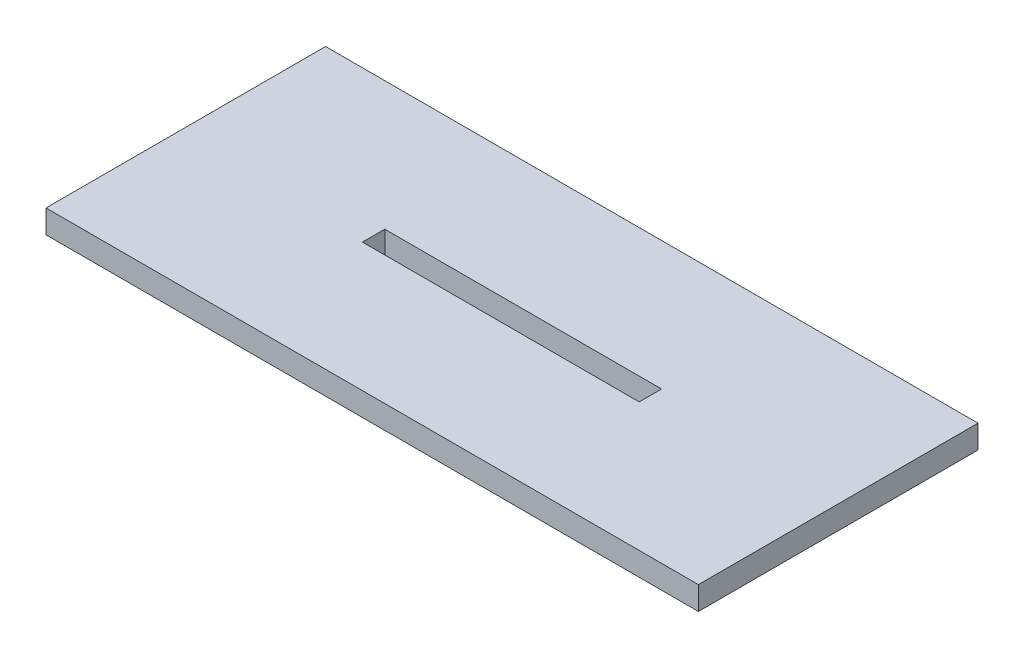
ISO-10303-21;
HEADER;
FILE_DESCRIPTION(('STEP AP214'),'2;1');
FILE_NAME('part.step','',(''),(''),'','','');
FILE_SCHEMA(('AUTOMOTIVE_DESIGN { 1 0 10303 214 1 1 1 1 }'));
ENDSEC;
DATA;
#1=APPLICATION_CONTEXT('core data for automotive mechanical design processes');
#2=APPLICATION_PROTOCOL_DEFINITION('international standard','automotive_design',2000,#1);
#3=PRODUCT_CONTEXT('',#1,'mechanical');
#4=PRODUCT('Part','Part','',(#3));
#5=PRODUCT_RELATED_PRODUCT_CATEGORY('part','',(#4));
#6=PRODUCT_DEFINITION_FORMATION('','',#4);
#7=PRODUCT_DEFINITION_CONTEXT('part definition',#1,'design');
#8=PRODUCT_DEFINITION('design','',#6,#7);
#9=PRODUCT_DEFINITION_SHAPE('','',#8);
#10=(LENGTH_UNIT() NAMED_UNIT(*) SI_UNIT(.MILLI.,.METRE.));
#11=(NAMED_UNIT(*) PLANE_ANGLE_UNIT() SI_UNIT($,.RADIAN.));
#12=(NAMED_UNIT(*) SI_UNIT($,.STERADIAN.) SOLID_ANGLE_UNIT());
#13=UNCERTAINTY_MEASURE_WITH_UNIT(LENGTH_MEASURE(1.E-05),#10,'distance_accuracy_value','');
#14=(GEOMETRIC_REPRESENTATION_CONTEXT(3) GLOBAL_UNCERTAINTY_ASSIGNED_CONTEXT((#13)) GLOBAL_UNIT_ASSIGNED_CONTEXT((#10,
#11,#12)) REPRESENTATION_CONTEXT('',''));
#15=CARTESIAN_POINT('',(0.,0.,0.));
#16=DIRECTION('',(0.,0.,1.));
#17=DIRECTION('',(1.,0.,0.));
#18=AXIS2_PLACEMENT_3D('',#15,#16,#17);
#19=CARTESIAN_POINT('',(0.,6.35,0.));
#20=DIRECTION('',(1.,0.,0.));
#21=DIRECTION('',(0.,0.,-1.));
#22=AXIS2_PLACEMENT_3D('',#19,#20,#21);
#23=PLANE('',#22);
#24=DIRECTION('',(0.,0.,1.));
#25=VECTOR('',#24,1.);
#26=CARTESIAN_POINT('',(0.,0.,0.));
#27=LINE('',#26,#25);
#28=CARTESIAN_POINT('',(0.,0.,-76.2));
#29=VERTEX_POINT('',#28);
#30=CARTESIAN_POINT('',(0.,0.,0.));
#31=VERTEX_POINT('',#30);
#32=EDGE_CURVE('E130',#29,#31,#27,.T.);
#33=ORIENTED_EDGE('',*,*,#32,.T.);
#34=DIRECTION('',(0.,-1.,0.));
#35=VECTOR('',#34,1.);
#36=CARTESIAN_POINT('',(0.,6.35,0.));
#37=LINE('',#36,#35);
#38=CARTESIAN_POINT('',(0.,6.35,0.));
#39=VERTEX_POINT('',#38);
#40=EDGE_CURVE('E11',#39,#31,#37,.T.);
#41=ORIENTED_EDGE('',*,*,#40,.F.);
#42=DIRECTION('',(0.,0.,1.));
#43=VECTOR('',#42,1.);
#44=CARTESIAN_POINT('',(0.,6.35,0.));
#45=LINE('',#44,#43);
#46=CARTESIAN_POINT('',(0.,6.35,-76.2));
#47=VERTEX_POINT('',#46);
#48=EDGE_CURVE('E134',#47,#39,#45,.T.);
#49=ORIENTED_EDGE('',*,*,#48,.F.);
#50=DIRECTION('',(0.,-1.,0.));
#51=VECTOR('',#50,1.);
#52=CARTESIAN_POINT('',(0.,6.35,-76.2));
#53=LINE('',#52,#51);
#54=EDGE_CURVE('E144',#47,#29,#53,.T.);
#55=ORIENTED_EDGE('',*,*,#54,.T.);
#56=EDGE_LOOP('',(#33,#41,#49,#55));
#57=FACE_BOUND('',#56,.T.);
#58=ADVANCED_FACE('F33',(#57),#23,.F.);
#59=CARTESIAN_POINT('',(0.,6.35,0.));
#60=DIRECTION('',(0.,0.,-1.));
#61=DIRECTION('',(-1.,0.,0.));
#62=AXIS2_PLACEMENT_3D('',#59,#60,#61);
#63=PLANE('',#62);
#64=DIRECTION('',(1.,0.,0.));
#65=VECTOR('',#64,1.);
#66=CARTESIAN_POINT('',(0.,0.,0.));
#67=LINE('',#66,#65);
#68=CARTESIAN_POINT('',(177.8,0.,0.));
#69=VERTEX_POINT('',#68);
#70=EDGE_CURVE('E147',#31,#69,#67,.T.);
#71=ORIENTED_EDGE('',*,*,#70,.T.);
#72=DIRECTION('',(0.,-1.,0.));
#73=VECTOR('',#72,1.);
#74=CARTESIAN_POINT('',(177.8,6.35,0.));
#75=LINE('',#74,#73);
#76=CARTESIAN_POINT('',(177.8,6.35,0.));
#77=VERTEX_POINT('',#76);
#78=EDGE_CURVE('E40',#77,#69,#75,.T.);
#79=ORIENTED_EDGE('',*,*,#78,.F.);
#80=DIRECTION('',(1.,0.,0.));
#81=VECTOR('',#80,1.);
#82=CARTESIAN_POINT('',(0.,6.35,0.));
#83=LINE('',#82,#81);
#84=EDGE_CURVE('E137',#39,#77,#83,.T.);
#85=ORIENTED_EDGE('',*,*,#84,.F.);
#86=ORIENTED_EDGE('',*,*,#40,.T.);
#87=EDGE_LOOP('',(#71,#79,#85,#86));
#88=FACE_BOUND('',#87,.T.);
#89=ADVANCED_FACE('F175',(#88),#63,.F.);
#90=CARTESIAN_POINT('',(177.8,6.35,0.));
#91=DIRECTION('',(-1.,0.,0.));
#92=DIRECTION('',(0.,0.,1.));
#93=AXIS2_PLACEMENT_3D('',#90,#91,#92);
#94=PLANE('',#93);
#95=DIRECTION('',(0.,0.,-1.));
#96=VECTOR('',#95,1.);
#97=CARTESIAN_POINT('',(177.8,0.,0.));
#98=LINE('',#97,#96);
#99=CARTESIAN_POINT('',(177.8,0.,-76.2));
#100=VERTEX_POINT('',#99);
#101=EDGE_CURVE('E149',#69,#100,#98,.T.);
#102=ORIENTED_EDGE('',*,*,#101,.T.);
#103=DIRECTION('',(0.,-1.,0.));
#104=VECTOR('',#103,1.);
#105=CARTESIAN_POINT('',(177.8,6.35,-76.2));
#106=LINE('',#105,#104);
#107=CARTESIAN_POINT('',(177.8,6.35,-76.2));
#108=VERTEX_POINT('',#107);
#109=EDGE_CURVE('E154',#108,#100,#106,.T.);
#110=ORIENTED_EDGE('',*,*,#109,.F.);
#111=DIRECTION('',(0.,0.,-1.));
#112=VECTOR('',#111,1.);
#113=CARTESIAN_POINT('',(177.8,6.35,0.));
#114=LINE('',#113,#112);
#115=EDGE_CURVE('E140',#77,#108,#114,.T.);
#116=ORIENTED_EDGE('',*,*,#115,.F.);
#117=ORIENTED_EDGE('',*,*,#78,.T.);
#118=EDGE_LOOP('',(#102,#110,#116,#117));
#119=FACE_BOUND('',#118,.T.);
#120=ADVANCED_FACE('F161',(#119),#94,.F.);
#121=CARTESIAN_POINT('',(0.,6.35,-76.2));
#122=DIRECTION('',(0.,0.,1.));
#123=DIRECTION('',(1.,0.,0.));
#124=AXIS2_PLACEMENT_3D('',#121,#122,#123);
#125=PLANE('',#124);
#126=DIRECTION('',(-1.,0.,0.));
#127=VECTOR('',#126,1.);
#128=CARTESIAN_POINT('',(0.,0.,-76.2));
#129=LINE('',#128,#127);
#130=EDGE_CURVE('E138',#100,#29,#129,.T.);
#131=ORIENTED_EDGE('',*,*,#130,.T.);
#132=ORIENTED_EDGE('',*,*,#54,.F.);
#133=DIRECTION('',(-1.,0.,0.));
#134=VECTOR('',#133,1.);
#135=CARTESIAN_POINT('',(0.,6.35,-76.2));
#136=LINE('',#135,#134);
#137=EDGE_CURVE('E142',#108,#47,#136,.T.);
#138=ORIENTED_EDGE('',*,*,#137,.F.);
#139=ORIENTED_EDGE('',*,*,#109,.T.);
#140=EDGE_LOOP('',(#131,#132,#138,#139));
#141=FACE_BOUND('',#140,.T.);
#142=ADVANCED_FACE('F168',(#141),#125,.F.);
#143=CARTESIAN_POINT('',(0.,6.35,-76.2));
#144=DIRECTION('',(0.,-1.,0.));
#145=DIRECTION('',(0.,0.,-1.));
#146=AXIS2_PLACEMENT_3D('',#143,#144,#145);
#147=PLANE('',#146);
#148=DIRECTION('',(-1.,0.,0.));
#149=VECTOR('',#148,1.);
#150=CARTESIAN_POINT('',(51.181,6.35,-41.148));
#151=LINE('',#150,#149);
#152=CARTESIAN_POINT('',(126.619,6.35,-41.148));
#153=VERTEX_POINT('',#152);
#154=CARTESIAN_POINT('',(51.181,6.35,-41.148));
#155=VERTEX_POINT('',#154);
#156=EDGE_CURVE('E124',#153,#155,#151,.T.);
#157=ORIENTED_EDGE('',*,*,#156,.F.);
#158=DIRECTION('',(0.,0.,-1.));
#159=VECTOR('',#158,1.);
#160=CARTESIAN_POINT('',(126.619,6.35,-35.052));
#161=LINE('',#160,#159);
#162=CARTESIAN_POINT('',(126.619,6.35,-35.052));
#163=VERTEX_POINT('',#162);
#164=EDGE_CURVE('E47',#163,#153,#161,.T.);
#165=ORIENTED_EDGE('',*,*,#164,.F.);
#166=DIRECTION('',(1.,0.,0.));
#167=VECTOR('',#166,1.);
#168=CARTESIAN_POINT('',(51.181,6.35,-35.052));
#169=LINE('',#168,#167);
#170=CARTESIAN_POINT('',(51.181,6.35,-35.052));
#171=VERTEX_POINT('',#170);
#172=EDGE_CURVE('E115',#171,#163,#169,.T.);
#173=ORIENTED_EDGE('',*,*,#172,.F.);
#174=DIRECTION('',(0.,0.,1.));
#175=VECTOR('',#174,1.);
#176=CARTESIAN_POINT('',(51.181,6.35,-35.052));
#177=LINE('',#176,#175);
#178=EDGE_CURVE('E118',#155,#171,#177,.T.);
#179=ORIENTED_EDGE('',*,*,#178,.F.);
#180=EDGE_LOOP('',(#157,#165,#173,#179));
#181=FACE_BOUND('',#180,.T.);
#182=ORIENTED_EDGE('',*,*,#48,.T.);
#183=ORIENTED_EDGE('',*,*,#84,.T.);
#184=ORIENTED_EDGE('',*,*,#115,.T.);
#185=ORIENTED_EDGE('',*,*,#137,.T.);
#186=EDGE_LOOP('',(#182,#183,#184,#185));
#187=FACE_BOUND('',#186,.T.);
#188=ADVANCED_FACE('F174',(#181,#187),#147,.F.);
#189=CARTESIAN_POINT('',(0.,0.,-76.2));
#190=DIRECTION('',(0.,-1.,0.));
#191=DIRECTION('',(0.,0.,-1.));
#192=AXIS2_PLACEMENT_3D('',#189,#190,#191);
#193=PLANE('',#192);
#194=DIRECTION('',(0.,0.,-1.));
#195=VECTOR('',#194,1.);
#196=CARTESIAN_POINT('',(126.619,0.,-35.052));
#197=LINE('',#196,#195);
#198=CARTESIAN_POINT('',(126.619,0.,-35.052));
#199=VERTEX_POINT('',#198);
#200=CARTESIAN_POINT('',(126.619,0.,-41.148));
#201=VERTEX_POINT('',#200);
#202=EDGE_CURVE('E99',#199,#201,#197,.T.);
#203=ORIENTED_EDGE('',*,*,#202,.T.);
#204=DIRECTION('',(-1.,0.,0.));
#205=VECTOR('',#204,1.);
#206=CARTESIAN_POINT('',(51.181,0.,-41.148));
#207=LINE('',#206,#205);
#208=CARTESIAN_POINT('',(51.181,0.,-41.148));
#209=VERTEX_POINT('',#208);
#210=EDGE_CURVE('E108',#201,#209,#207,.T.);
#211=ORIENTED_EDGE('',*,*,#210,.T.);
#212=DIRECTION('',(0.,0.,1.));
#213=VECTOR('',#212,1.);
#214=CARTESIAN_POINT('',(51.181,0.,-35.052));
#215=LINE('',#214,#213);
#216=CARTESIAN_POINT('',(51.181,0.,-35.052));
#217=VERTEX_POINT('',#216);
#218=EDGE_CURVE('E55',#209,#217,#215,.T.);
#219=ORIENTED_EDGE('',*,*,#218,.T.);
#220=DIRECTION('',(1.,0.,0.));
#221=VECTOR('',#220,1.);
#222=CARTESIAN_POINT('',(51.181,0.,-35.052));
#223=LINE('',#222,#221);
#224=EDGE_CURVE('E105',#217,#199,#223,.T.);
#225=ORIENTED_EDGE('',*,*,#224,.T.);
#226=EDGE_LOOP('',(#203,#211,#219,#225));
#227=FACE_BOUND('',#226,.T.);
#228=ORIENTED_EDGE('',*,*,#32,.F.);
#229=ORIENTED_EDGE('',*,*,#130,.F.);
#230=ORIENTED_EDGE('',*,*,#101,.F.);
#231=ORIENTED_EDGE('',*,*,#70,.F.);
#232=EDGE_LOOP('',(#228,#229,#230,#231));
#233=FACE_BOUND('',#232,.T.);
#234=ADVANCED_FACE('F112',(#227,#233),#193,.T.);
#235=CARTESIAN_POINT('',(126.619,0.,-35.052));
#236=DIRECTION('',(1.,0.,0.));
#237=DIRECTION('',(0.,0.,-1.));
#238=AXIS2_PLACEMENT_3D('',#235,#236,#237);
#239=PLANE('',#238);
#240=ORIENTED_EDGE('',*,*,#164,.T.);
#241=DIRECTION('',(0.,1.,0.));
#242=VECTOR('',#241,1.);
#243=CARTESIAN_POINT('',(126.619,0.,-41.148));
#244=LINE('',#243,#242);
#245=EDGE_CURVE('E95',#201,#153,#244,.T.);
#246=ORIENTED_EDGE('',*,*,#245,.F.);
#247=ORIENTED_EDGE('',*,*,#202,.F.);
#248=DIRECTION('',(0.,1.,0.));
#249=VECTOR('',#248,1.);
#250=CARTESIAN_POINT('',(126.619,0.,-35.052));
#251=LINE('',#250,#249);
#252=EDGE_CURVE('E128',#199,#163,#251,.T.);
#253=ORIENTED_EDGE('',*,*,#252,.T.);
#254=EDGE_LOOP('',(#240,#246,#247,#253));
#255=FACE_BOUND('',#254,.T.);
#256=ADVANCED_FACE('F97',(#255),#239,.F.);
#257=CARTESIAN_POINT('',(51.181,0.,-35.052));
#258=DIRECTION('',(0.,0.,1.));
#259=DIRECTION('',(1.,0.,0.));
#260=AXIS2_PLACEMENT_3D('',#257,#258,#259);
#261=PLANE('',#260);
#262=ORIENTED_EDGE('',*,*,#172,.T.);
#263=ORIENTED_EDGE('',*,*,#252,.F.);
#264=ORIENTED_EDGE('',*,*,#224,.F.);
#265=DIRECTION('',(0.,1.,0.));
#266=VECTOR('',#265,1.);
#267=CARTESIAN_POINT('',(51.181,0.,-35.052));
#268=LINE('',#267,#266);
#269=EDGE_CURVE('E131',#217,#171,#268,.T.);
#270=ORIENTED_EDGE('',*,*,#269,.T.);
#271=EDGE_LOOP('',(#262,#263,#264,#270));
#272=FACE_BOUND('',#271,.T.);
#273=ADVANCED_FACE('F192',(#272),#261,.F.);
#274=CARTESIAN_POINT('',(51.181,0.,-35.052));
#275=DIRECTION('',(-1.,0.,0.));
#276=DIRECTION('',(0.,0.,1.));
#277=AXIS2_PLACEMENT_3D('',#274,#275,#276);
#278=PLANE('',#277);
#279=ORIENTED_EDGE('',*,*,#178,.T.);
#280=ORIENTED_EDGE('',*,*,#269,.F.);
#281=ORIENTED_EDGE('',*,*,#218,.F.);
#282=DIRECTION('',(0.,1.,0.));
#283=VECTOR('',#282,1.);
#284=CARTESIAN_POINT('',(51.181,0.,-41.148));
#285=LINE('',#284,#283);
#286=EDGE_CURVE('E104',#209,#155,#285,.T.);
#287=ORIENTED_EDGE('',*,*,#286,.T.);
#288=EDGE_LOOP('',(#279,#280,#281,#287));
#289=FACE_BOUND('',#288,.T.);
#290=ADVANCED_FACE('F195',(#289),#278,.F.);
#291=CARTESIAN_POINT('',(51.181,0.,-41.148));
#292=DIRECTION('',(0.,0.,-1.));
#293=DIRECTION('',(-1.,0.,0.));
#294=AXIS2_PLACEMENT_3D('',#291,#292,#293);
#295=PLANE('',#294);
#296=ORIENTED_EDGE('',*,*,#156,.T.);
#297=ORIENTED_EDGE('',*,*,#286,.F.);
#298=ORIENTED_EDGE('',*,*,#210,.F.);
#299=ORIENTED_EDGE('',*,*,#245,.T.);
#300=EDGE_LOOP('',(#296,#297,#298,#299));
#301=FACE_BOUND('',#300,.T.);
#302=ADVANCED_FACE('F109',(#301),#295,.F.);
#303=CLOSED_SHELL('',(#58,#89,#120,#142,#188,#234,#256,#273,#290,#302));
#304=MANIFOLD_SOLID_BREP('B2',#303);
#305=ADVANCED_BREP_SHAPE_REPRESENTATION('',(#18,#304),#14);
#306=SHAPE_DEFINITION_REPRESENTATION(#9,#305);
ENDSEC;
END-ISO-10303-21;
